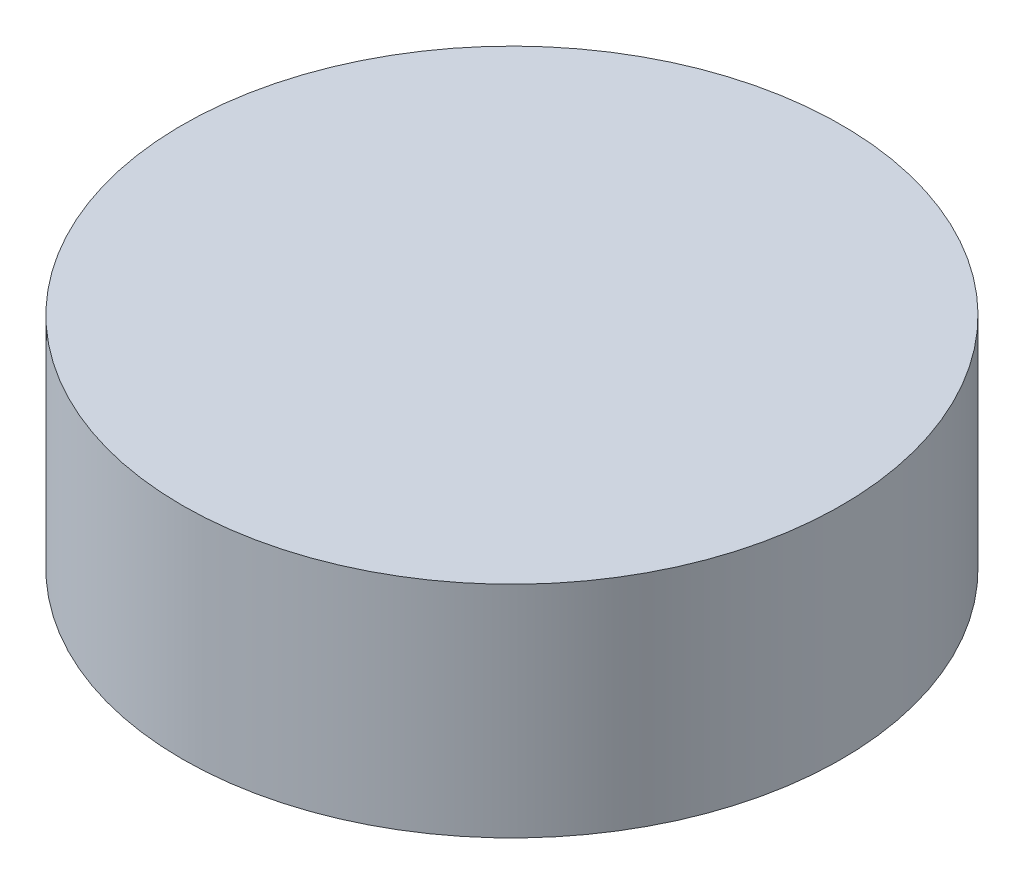
ISO-10303-21;
HEADER;
FILE_DESCRIPTION(('STEP AP214'),'2;1');
FILE_NAME('part.step','',(''),(''),'','','');
FILE_SCHEMA(('AUTOMOTIVE_DESIGN { 1 0 10303 214 1 1 1 1 }'));
ENDSEC;
DATA;
#1=APPLICATION_CONTEXT('core data for automotive mechanical design processes');
#2=APPLICATION_PROTOCOL_DEFINITION('international standard','automotive_design',2000,#1);
#3=PRODUCT_CONTEXT('',#1,'mechanical');
#4=PRODUCT('Part','Part','',(#3));
#5=PRODUCT_RELATED_PRODUCT_CATEGORY('part','',(#4));
#6=PRODUCT_DEFINITION_FORMATION('','',#4);
#7=PRODUCT_DEFINITION_CONTEXT('part definition',#1,'design');
#8=PRODUCT_DEFINITION('design','',#6,#7);
#9=PRODUCT_DEFINITION_SHAPE('','',#8);
#10=(LENGTH_UNIT() NAMED_UNIT(*) SI_UNIT(.MILLI.,.METRE.));
#11=(NAMED_UNIT(*) PLANE_ANGLE_UNIT() SI_UNIT($,.RADIAN.));
#12=(NAMED_UNIT(*) SI_UNIT($,.STERADIAN.) SOLID_ANGLE_UNIT());
#13=UNCERTAINTY_MEASURE_WITH_UNIT(LENGTH_MEASURE(1.E-05),#10,'distance_accuracy_value','');
#14=(GEOMETRIC_REPRESENTATION_CONTEXT(3) GLOBAL_UNCERTAINTY_ASSIGNED_CONTEXT((#13)) GLOBAL_UNIT_ASSIGNED_CONTEXT((#10,
#11,#12)) REPRESENTATION_CONTEXT('',''));
#15=CARTESIAN_POINT('',(0.,0.,0.));
#16=DIRECTION('',(0.,0.,1.));
#17=DIRECTION('',(1.,0.,0.));
#18=AXIS2_PLACEMENT_3D('',#15,#16,#17);
#19=CARTESIAN_POINT('',(0.,1.,0.));
#20=DIRECTION('',(0.,-1.,0.));
#21=DIRECTION('',(0.,0.,-1.));
#22=AXIS2_PLACEMENT_3D('',#19,#20,#21);
#23=CYLINDRICAL_SURFACE('',#22,1.5);
#24=CARTESIAN_POINT('',(0.,1.,0.));
#25=DIRECTION('',(0.,1.,0.));
#26=DIRECTION('',(0.,0.,1.));
#27=AXIS2_PLACEMENT_3D('',#24,#25,#26);
#28=CIRCLE('',#27,1.5);
#29=CARTESIAN_POINT('',(0.,1.,1.5));
#30=VERTEX_POINT('',#29);
#31=EDGE_CURVE('E10',#30,#30,#28,.T.);
#32=ORIENTED_EDGE('',*,*,#31,.F.);
#33=EDGE_LOOP('',(#32));
#34=FACE_BOUND('',#33,.T.);
#35=CARTESIAN_POINT('',(0.,0.,0.));
#36=DIRECTION('',(0.,1.,0.));
#37=DIRECTION('',(0.,0.,1.));
#38=AXIS2_PLACEMENT_3D('',#35,#36,#37);
#39=CIRCLE('',#38,1.5);
#40=CARTESIAN_POINT('',(0.,0.,1.5));
#41=VERTEX_POINT('',#40);
#42=EDGE_CURVE('E44',#41,#41,#39,.T.);
#43=ORIENTED_EDGE('',*,*,#42,.T.);
#44=EDGE_LOOP('',(#43));
#45=FACE_BOUND('',#44,.T.);
#46=ADVANCED_FACE('F41',(#34,#45),#23,.T.);
#47=CARTESIAN_POINT('',(0.,1.,0.));
#48=DIRECTION('',(0.,1.,0.));
#49=DIRECTION('',(0.,0.,1.));
#50=AXIS2_PLACEMENT_3D('',#47,#48,#49);
#51=PLANE('',#50);
#52=ORIENTED_EDGE('',*,*,#31,.T.);
#53=EDGE_LOOP('',(#52));
#54=FACE_BOUND('',#53,.T.);
#55=ADVANCED_FACE('F58',(#54),#51,.T.);
#56=CARTESIAN_POINT('',(0.,0.,0.));
#57=DIRECTION('',(0.,1.,0.));
#58=DIRECTION('',(0.,0.,1.));
#59=AXIS2_PLACEMENT_3D('',#56,#57,#58);
#60=PLANE('',#59);
#61=ORIENTED_EDGE('',*,*,#42,.F.);
#62=EDGE_LOOP('',(#61));
#63=FACE_BOUND('',#62,.T.);
#64=ADVANCED_FACE('F56',(#63),#60,.F.);
#65=CLOSED_SHELL('',(#46,#55,#64));
#66=MANIFOLD_SOLID_BREP('B2',#65);
#67=ADVANCED_BREP_SHAPE_REPRESENTATION('',(#18,#66),#14);
#68=SHAPE_DEFINITION_REPRESENTATION(#9,#67);
ENDSEC;
END-ISO-10303-21;
